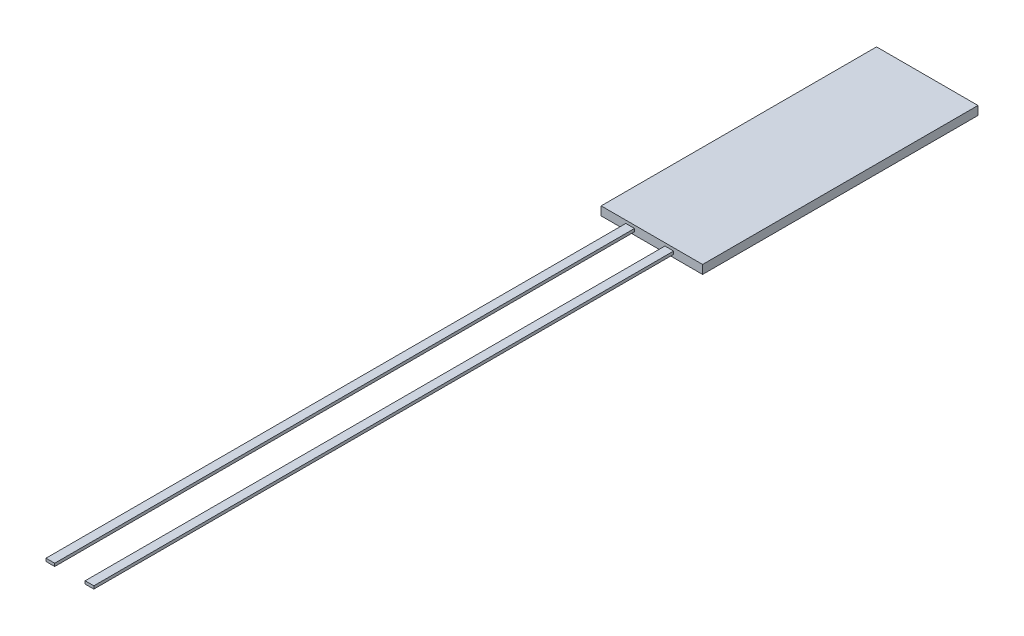
ISO-10303-21;
HEADER;
FILE_DESCRIPTION(('STEP AP214'),'2;1');
FILE_NAME('part.step','',(''),(''),'','','');
FILE_SCHEMA(('AUTOMOTIVE_DESIGN { 1 0 10303 214 1 1 1 1 }'));
ENDSEC;
DATA;
#1=APPLICATION_CONTEXT('core data for automotive mechanical design processes');
#2=APPLICATION_PROTOCOL_DEFINITION('international standard','automotive_design',2000,#1);
#3=PRODUCT_CONTEXT('',#1,'mechanical');
#4=PRODUCT('Part','Part','',(#3));
#5=PRODUCT_RELATED_PRODUCT_CATEGORY('part','',(#4));
#6=PRODUCT_DEFINITION_FORMATION('','',#4);
#7=PRODUCT_DEFINITION_CONTEXT('part definition',#1,'design');
#8=PRODUCT_DEFINITION('design','',#6,#7);
#9=PRODUCT_DEFINITION_SHAPE('','',#8);
#10=(LENGTH_UNIT() NAMED_UNIT(*) SI_UNIT(.MILLI.,.METRE.));
#11=(NAMED_UNIT(*) PLANE_ANGLE_UNIT() SI_UNIT($,.RADIAN.));
#12=(NAMED_UNIT(*) SI_UNIT($,.STERADIAN.) SOLID_ANGLE_UNIT());
#13=UNCERTAINTY_MEASURE_WITH_UNIT(LENGTH_MEASURE(1.E-05),#10,'distance_accuracy_value','');
#14=(GEOMETRIC_REPRESENTATION_CONTEXT(3) GLOBAL_UNCERTAINTY_ASSIGNED_CONTEXT((#13)) GLOBAL_UNIT_ASSIGNED_CONTEXT((#10,
#11,#12)) REPRESENTATION_CONTEXT('',''));
#15=CARTESIAN_POINT('',(0.,0.,0.));
#16=DIRECTION('',(0.,0.,1.));
#17=DIRECTION('',(1.,0.,0.));
#18=AXIS2_PLACEMENT_3D('',#15,#16,#17);
#19=CARTESIAN_POINT('',(-1.75,0.3,4.75));
#20=DIRECTION('',(0.,0.,-1.));
#21=DIRECTION('',(-1.,0.,0.));
#22=AXIS2_PLACEMENT_3D('',#19,#20,#21);
#23=PLANE('',#22);
#24=DIRECTION('',(0.,1.,0.));
#25=VECTOR('',#24,1.);
#26=CARTESIAN_POINT('',(-0.600000000000001,0.2,4.75));
#27=LINE('',#26,#25);
#28=CARTESIAN_POINT('',(-0.600000000000001,0.1,4.75));
#29=VERTEX_POINT('',#28);
#30=CARTESIAN_POINT('',(-0.600000000000001,0.2,4.75));
#31=VERTEX_POINT('',#30);
#32=EDGE_CURVE('E148',#29,#31,#27,.T.);
#33=ORIENTED_EDGE('',*,*,#32,.F.);
#34=DIRECTION('',(1.,0.,0.));
#35=VECTOR('',#34,1.);
#36=CARTESIAN_POINT('',(-0.900000000000001,0.1,4.75));
#37=LINE('',#36,#35);
#38=CARTESIAN_POINT('',(-0.900000000000001,0.1,4.75));
#39=VERTEX_POINT('',#38);
#40=EDGE_CURVE('E161',#39,#29,#37,.T.);
#41=ORIENTED_EDGE('',*,*,#40,.F.);
#42=DIRECTION('',(0.,-1.,0.));
#43=VECTOR('',#42,1.);
#44=CARTESIAN_POINT('',(-0.900000000000001,0.2,4.75));
#45=LINE('',#44,#43);
#46=CARTESIAN_POINT('',(-0.900000000000001,0.2,4.75));
#47=VERTEX_POINT('',#46);
#48=EDGE_CURVE('E170',#47,#39,#45,.T.);
#49=ORIENTED_EDGE('',*,*,#48,.F.);
#50=DIRECTION('',(-1.,0.,0.));
#51=VECTOR('',#50,1.);
#52=CARTESIAN_POINT('',(-0.900000000000001,0.2,4.75));
#53=LINE('',#52,#51);
#54=EDGE_CURVE('E151',#31,#47,#53,.T.);
#55=ORIENTED_EDGE('',*,*,#54,.F.);
#56=EDGE_LOOP('',(#33,#41,#49,#55));
#57=FACE_BOUND('',#56,.T.);
#58=DIRECTION('',(1.,0.,0.));
#59=VECTOR('',#58,1.);
#60=CARTESIAN_POINT('',(-1.75,0.,4.75));
#61=LINE('',#60,#59);
#62=CARTESIAN_POINT('',(-1.75,0.,4.75));
#63=VERTEX_POINT('',#62);
#64=CARTESIAN_POINT('',(1.75,0.,4.75));
#65=VERTEX_POINT('',#64);
#66=EDGE_CURVE('E191',#63,#65,#61,.T.);
#67=ORIENTED_EDGE('',*,*,#66,.T.);
#68=DIRECTION('',(0.,-1.,0.));
#69=VECTOR('',#68,1.);
#70=CARTESIAN_POINT('',(1.75,0.3,4.75));
#71=LINE('',#70,#69);
#72=CARTESIAN_POINT('',(1.75,0.3,4.75));
#73=VERTEX_POINT('',#72);
#74=EDGE_CURVE('E197',#73,#65,#71,.T.);
#75=ORIENTED_EDGE('',*,*,#74,.F.);
#76=DIRECTION('',(1.,0.,0.));
#77=VECTOR('',#76,1.);
#78=CARTESIAN_POINT('',(-1.75,0.3,4.75));
#79=LINE('',#78,#77);
#80=CARTESIAN_POINT('',(-1.75,0.3,4.75));
#81=VERTEX_POINT('',#80);
#82=EDGE_CURVE('E195',#81,#73,#79,.T.);
#83=ORIENTED_EDGE('',*,*,#82,.F.);
#84=DIRECTION('',(0.,-1.,0.));
#85=VECTOR('',#84,1.);
#86=CARTESIAN_POINT('',(-1.75,0.3,4.75));
#87=LINE('',#86,#85);
#88=EDGE_CURVE('E207',#81,#63,#87,.T.);
#89=ORIENTED_EDGE('',*,*,#88,.T.);
#90=EDGE_LOOP('',(#67,#75,#83,#89));
#91=FACE_BOUND('',#90,.T.);
#92=DIRECTION('',(1.,0.,0.));
#93=VECTOR('',#92,1.);
#94=CARTESIAN_POINT('',(0.450000000000001,0.1,4.75));
#95=LINE('',#94,#93);
#96=CARTESIAN_POINT('',(0.450000000000001,0.1,4.75));
#97=VERTEX_POINT('',#96);
#98=CARTESIAN_POINT('',(0.75,0.1,4.75));
#99=VERTEX_POINT('',#98);
#100=EDGE_CURVE('E147',#97,#99,#95,.T.);
#101=ORIENTED_EDGE('',*,*,#100,.F.);
#102=DIRECTION('',(0.,-1.,0.));
#103=VECTOR('',#102,1.);
#104=CARTESIAN_POINT('',(0.450000000000001,0.2,4.75));
#105=LINE('',#104,#103);
#106=CARTESIAN_POINT('',(0.450000000000001,0.2,4.75));
#107=VERTEX_POINT('',#106);
#108=EDGE_CURVE('E144',#107,#97,#105,.T.);
#109=ORIENTED_EDGE('',*,*,#108,.F.);
#110=DIRECTION('',(-1.,0.,0.));
#111=VECTOR('',#110,1.);
#112=CARTESIAN_POINT('',(0.450000000000001,0.2,4.75));
#113=LINE('',#112,#111);
#114=CARTESIAN_POINT('',(0.75,0.2,4.75));
#115=VERTEX_POINT('',#114);
#116=EDGE_CURVE('E58',#115,#107,#113,.T.);
#117=ORIENTED_EDGE('',*,*,#116,.F.);
#118=DIRECTION('',(0.,1.,0.));
#119=VECTOR('',#118,1.);
#120=CARTESIAN_POINT('',(0.75,0.2,4.75));
#121=LINE('',#120,#119);
#122=EDGE_CURVE('E53',#99,#115,#121,.T.);
#123=ORIENTED_EDGE('',*,*,#122,.F.);
#124=EDGE_LOOP('',(#101,#109,#117,#123));
#125=FACE_BOUND('',#124,.T.);
#126=ADVANCED_FACE('F38',(#57,#91,#125),#23,.F.);
#127=CARTESIAN_POINT('',(1.75,0.3,-4.75));
#128=DIRECTION('',(-1.,0.,0.));
#129=DIRECTION('',(0.,0.,1.));
#130=AXIS2_PLACEMENT_3D('',#127,#128,#129);
#131=PLANE('',#130);
#132=DIRECTION('',(0.,0.,-1.));
#133=VECTOR('',#132,1.);
#134=CARTESIAN_POINT('',(1.75,0.,-4.75));
#135=LINE('',#134,#133);
#136=CARTESIAN_POINT('',(1.75,0.,-4.75));
#137=VERTEX_POINT('',#136);
#138=EDGE_CURVE('E186',#65,#137,#135,.T.);
#139=ORIENTED_EDGE('',*,*,#138,.T.);
#140=DIRECTION('',(0.,-1.,0.));
#141=VECTOR('',#140,1.);
#142=CARTESIAN_POINT('',(1.75,0.3,-4.75));
#143=LINE('',#142,#141);
#144=CARTESIAN_POINT('',(1.75,0.3,-4.75));
#145=VERTEX_POINT('',#144);
#146=EDGE_CURVE('E11',#145,#137,#143,.T.);
#147=ORIENTED_EDGE('',*,*,#146,.F.);
#148=DIRECTION('',(0.,0.,-1.));
#149=VECTOR('',#148,1.);
#150=CARTESIAN_POINT('',(1.75,0.3,-4.75));
#151=LINE('',#150,#149);
#152=EDGE_CURVE('E187',#73,#145,#151,.T.);
#153=ORIENTED_EDGE('',*,*,#152,.F.);
#154=ORIENTED_EDGE('',*,*,#74,.T.);
#155=EDGE_LOOP('',(#139,#147,#153,#154));
#156=FACE_BOUND('',#155,.T.);
#157=ADVANCED_FACE('F40',(#156),#131,.F.);
#158=CARTESIAN_POINT('',(-1.75,0.3,-4.75));
#159=DIRECTION('',(0.,0.,1.));
#160=DIRECTION('',(1.,0.,0.));
#161=AXIS2_PLACEMENT_3D('',#158,#159,#160);
#162=PLANE('',#161);
#163=DIRECTION('',(-1.,0.,0.));
#164=VECTOR('',#163,1.);
#165=CARTESIAN_POINT('',(-1.75,0.,-4.75));
#166=LINE('',#165,#164);
#167=CARTESIAN_POINT('',(-1.75,0.,-4.75));
#168=VERTEX_POINT('',#167);
#169=EDGE_CURVE('E200',#137,#168,#166,.T.);
#170=ORIENTED_EDGE('',*,*,#169,.T.);
#171=DIRECTION('',(0.,-1.,0.));
#172=VECTOR('',#171,1.);
#173=CARTESIAN_POINT('',(-1.75,0.3,-4.75));
#174=LINE('',#173,#172);
#175=CARTESIAN_POINT('',(-1.75,0.3,-4.75));
#176=VERTEX_POINT('',#175);
#177=EDGE_CURVE('E46',#176,#168,#174,.T.);
#178=ORIENTED_EDGE('',*,*,#177,.F.);
#179=DIRECTION('',(-1.,0.,0.));
#180=VECTOR('',#179,1.);
#181=CARTESIAN_POINT('',(-1.75,0.3,-4.75));
#182=LINE('',#181,#180);
#183=EDGE_CURVE('E190',#145,#176,#182,.T.);
#184=ORIENTED_EDGE('',*,*,#183,.F.);
#185=ORIENTED_EDGE('',*,*,#146,.T.);
#186=EDGE_LOOP('',(#170,#178,#184,#185));
#187=FACE_BOUND('',#186,.T.);
#188=ADVANCED_FACE('F229',(#187),#162,.F.);
#189=CARTESIAN_POINT('',(-1.75,0.3,-4.75));
#190=DIRECTION('',(1.,0.,0.));
#191=DIRECTION('',(0.,0.,-1.));
#192=AXIS2_PLACEMENT_3D('',#189,#190,#191);
#193=PLANE('',#192);
#194=DIRECTION('',(0.,0.,1.));
#195=VECTOR('',#194,1.);
#196=CARTESIAN_POINT('',(-1.75,0.,-4.75));
#197=LINE('',#196,#195);
#198=EDGE_CURVE('E202',#168,#63,#197,.T.);
#199=ORIENTED_EDGE('',*,*,#198,.T.);
#200=ORIENTED_EDGE('',*,*,#88,.F.);
#201=DIRECTION('',(0.,0.,1.));
#202=VECTOR('',#201,1.);
#203=CARTESIAN_POINT('',(-1.75,0.3,-4.75));
#204=LINE('',#203,#202);
#205=EDGE_CURVE('E193',#176,#81,#204,.T.);
#206=ORIENTED_EDGE('',*,*,#205,.F.);
#207=ORIENTED_EDGE('',*,*,#177,.T.);
#208=EDGE_LOOP('',(#199,#200,#206,#207));
#209=FACE_BOUND('',#208,.T.);
#210=ADVANCED_FACE('F214',(#209),#193,.F.);
#211=CARTESIAN_POINT('',(0.,0.3,0.));
#212=DIRECTION('',(0.,1.,0.));
#213=DIRECTION('',(0.,0.,1.));
#214=AXIS2_PLACEMENT_3D('',#211,#212,#213);
#215=PLANE('',#214);
#216=ORIENTED_EDGE('',*,*,#152,.T.);
#217=ORIENTED_EDGE('',*,*,#183,.T.);
#218=ORIENTED_EDGE('',*,*,#205,.T.);
#219=ORIENTED_EDGE('',*,*,#82,.T.);
#220=EDGE_LOOP('',(#216,#217,#218,#219));
#221=FACE_BOUND('',#220,.T.);
#222=ADVANCED_FACE('F228',(#221),#215,.T.);
#223=CARTESIAN_POINT('',(0.,0.,0.));
#224=DIRECTION('',(0.,1.,0.));
#225=DIRECTION('',(0.,0.,1.));
#226=AXIS2_PLACEMENT_3D('',#223,#224,#225);
#227=PLANE('',#226);
#228=ORIENTED_EDGE('',*,*,#138,.F.);
#229=ORIENTED_EDGE('',*,*,#66,.F.);
#230=ORIENTED_EDGE('',*,*,#198,.F.);
#231=ORIENTED_EDGE('',*,*,#169,.F.);
#232=EDGE_LOOP('',(#228,#229,#230,#231));
#233=FACE_BOUND('',#232,.T.);
#234=ADVANCED_FACE('F220',(#233),#227,.F.);
#235=CARTESIAN_POINT('',(-0.600000000000001,0.2,24.75));
#236=DIRECTION('',(-1.,0.,0.));
#237=DIRECTION('',(0.,0.,1.));
#238=AXIS2_PLACEMENT_3D('',#235,#236,#237);
#239=PLANE('',#238);
#240=ORIENTED_EDGE('',*,*,#32,.T.);
#241=DIRECTION('',(0.,0.,-1.));
#242=VECTOR('',#241,1.);
#243=CARTESIAN_POINT('',(-0.600000000000001,0.2,24.75));
#244=LINE('',#243,#242);
#245=CARTESIAN_POINT('',(-0.600000000000001,0.2,24.75));
#246=VERTEX_POINT('',#245);
#247=EDGE_CURVE('E183',#246,#31,#244,.T.);
#248=ORIENTED_EDGE('',*,*,#247,.F.);
#249=DIRECTION('',(0.,1.,0.));
#250=VECTOR('',#249,1.);
#251=CARTESIAN_POINT('',(-0.600000000000001,0.2,24.75));
#252=LINE('',#251,#250);
#253=CARTESIAN_POINT('',(-0.600000000000001,0.1,24.75));
#254=VERTEX_POINT('',#253);
#255=EDGE_CURVE('E157',#254,#246,#252,.T.);
#256=ORIENTED_EDGE('',*,*,#255,.F.);
#257=DIRECTION('',(0.,0.,-1.));
#258=VECTOR('',#257,1.);
#259=CARTESIAN_POINT('',(-0.600000000000001,0.1,24.75));
#260=LINE('',#259,#258);
#261=EDGE_CURVE('E166',#254,#29,#260,.T.);
#262=ORIENTED_EDGE('',*,*,#261,.T.);
#263=EDGE_LOOP('',(#240,#248,#256,#262));
#264=FACE_BOUND('',#263,.T.);
#265=ADVANCED_FACE('F244',(#264),#239,.F.);
#266=CARTESIAN_POINT('',(-0.900000000000001,0.2,24.75));
#267=DIRECTION('',(0.,-1.,0.));
#268=DIRECTION('',(0.,0.,-1.));
#269=AXIS2_PLACEMENT_3D('',#266,#267,#268);
#270=PLANE('',#269);
#271=ORIENTED_EDGE('',*,*,#54,.T.);
#272=DIRECTION('',(0.,0.,-1.));
#273=VECTOR('',#272,1.);
#274=CARTESIAN_POINT('',(-0.900000000000001,0.2,24.75));
#275=LINE('',#274,#273);
#276=CARTESIAN_POINT('',(-0.900000000000001,0.2,24.75));
#277=VERTEX_POINT('',#276);
#278=EDGE_CURVE('E180',#277,#47,#275,.T.);
#279=ORIENTED_EDGE('',*,*,#278,.F.);
#280=DIRECTION('',(-1.,0.,0.));
#281=VECTOR('',#280,1.);
#282=CARTESIAN_POINT('',(-0.900000000000001,0.2,24.75));
#283=LINE('',#282,#281);
#284=EDGE_CURVE('E160',#246,#277,#283,.T.);
#285=ORIENTED_EDGE('',*,*,#284,.F.);
#286=ORIENTED_EDGE('',*,*,#247,.T.);
#287=EDGE_LOOP('',(#271,#279,#285,#286));
#288=FACE_BOUND('',#287,.T.);
#289=ADVANCED_FACE('F249',(#288),#270,.F.);
#290=CARTESIAN_POINT('',(-0.900000000000001,0.2,24.75));
#291=DIRECTION('',(1.,0.,0.));
#292=DIRECTION('',(0.,0.,-1.));
#293=AXIS2_PLACEMENT_3D('',#290,#291,#292);
#294=PLANE('',#293);
#295=ORIENTED_EDGE('',*,*,#48,.T.);
#296=DIRECTION('',(0.,0.,-1.));
#297=VECTOR('',#296,1.);
#298=CARTESIAN_POINT('',(-0.900000000000001,0.1,24.75));
#299=LINE('',#298,#297);
#300=CARTESIAN_POINT('',(-0.900000000000001,0.1,24.75));
#301=VERTEX_POINT('',#300);
#302=EDGE_CURVE('E177',#301,#39,#299,.T.);
#303=ORIENTED_EDGE('',*,*,#302,.F.);
#304=DIRECTION('',(0.,-1.,0.));
#305=VECTOR('',#304,1.);
#306=CARTESIAN_POINT('',(-0.900000000000001,0.2,24.75));
#307=LINE('',#306,#305);
#308=EDGE_CURVE('E163',#277,#301,#307,.T.);
#309=ORIENTED_EDGE('',*,*,#308,.F.);
#310=ORIENTED_EDGE('',*,*,#278,.T.);
#311=EDGE_LOOP('',(#295,#303,#309,#310));
#312=FACE_BOUND('',#311,.T.);
#313=ADVANCED_FACE('F253',(#312),#294,.F.);
#314=CARTESIAN_POINT('',(-0.900000000000001,0.1,24.75));
#315=DIRECTION('',(0.,1.,0.));
#316=DIRECTION('',(0.,0.,1.));
#317=AXIS2_PLACEMENT_3D('',#314,#315,#316);
#318=PLANE('',#317);
#319=ORIENTED_EDGE('',*,*,#40,.T.);
#320=ORIENTED_EDGE('',*,*,#261,.F.);
#321=DIRECTION('',(1.,0.,0.));
#322=VECTOR('',#321,1.);
#323=CARTESIAN_POINT('',(-0.900000000000001,0.1,24.75));
#324=LINE('',#323,#322);
#325=EDGE_CURVE('E165',#301,#254,#324,.T.);
#326=ORIENTED_EDGE('',*,*,#325,.F.);
#327=ORIENTED_EDGE('',*,*,#302,.T.);
#328=EDGE_LOOP('',(#319,#320,#326,#327));
#329=FACE_BOUND('',#328,.T.);
#330=ADVANCED_FACE('F257',(#329),#318,.F.);
#331=CARTESIAN_POINT('',(0.,0.,24.75));
#332=DIRECTION('',(0.,0.,1.));
#333=DIRECTION('',(1.,0.,0.));
#334=AXIS2_PLACEMENT_3D('',#331,#332,#333);
#335=PLANE('',#334);
#336=ORIENTED_EDGE('',*,*,#255,.T.);
#337=ORIENTED_EDGE('',*,*,#284,.T.);
#338=ORIENTED_EDGE('',*,*,#308,.T.);
#339=ORIENTED_EDGE('',*,*,#325,.T.);
#340=EDGE_LOOP('',(#336,#337,#338,#339));
#341=FACE_BOUND('',#340,.T.);
#342=ADVANCED_FACE('F261',(#341),#335,.T.);
#343=CARTESIAN_POINT('',(0.450000000000001,0.1,24.75));
#344=DIRECTION('',(0.,1.,0.));
#345=DIRECTION('',(-1.,0.,0.));
#346=AXIS2_PLACEMENT_3D('',#343,#344,#345);
#347=PLANE('',#346);
#348=ORIENTED_EDGE('',*,*,#100,.T.);
#349=DIRECTION('',(0.,0.,-1.));
#350=VECTOR('',#349,1.);
#351=CARTESIAN_POINT('',(0.75,0.1,24.75));
#352=LINE('',#351,#350);
#353=CARTESIAN_POINT('',(0.75,0.1,24.75));
#354=VERTEX_POINT('',#353);
#355=EDGE_CURVE('E128',#354,#99,#352,.T.);
#356=ORIENTED_EDGE('',*,*,#355,.F.);
#357=DIRECTION('',(1.,0.,0.));
#358=VECTOR('',#357,1.);
#359=CARTESIAN_POINT('',(0.450000000000001,0.1,24.75));
#360=LINE('',#359,#358);
#361=CARTESIAN_POINT('',(0.450000000000001,0.1,24.75));
#362=VERTEX_POINT('',#361);
#363=EDGE_CURVE('E135',#362,#354,#360,.T.);
#364=ORIENTED_EDGE('',*,*,#363,.F.);
#365=DIRECTION('',(0.,0.,-1.));
#366=VECTOR('',#365,1.);
#367=CARTESIAN_POINT('',(0.450000000000001,0.1,24.75));
#368=LINE('',#367,#366);
#369=EDGE_CURVE('E373',#362,#97,#368,.T.);
#370=ORIENTED_EDGE('',*,*,#369,.T.);
#371=EDGE_LOOP('',(#348,#356,#364,#370));
#372=FACE_BOUND('',#371,.T.);
#373=ADVANCED_FACE('F146',(#372),#347,.F.);
#374=CARTESIAN_POINT('',(0.75,0.2,24.75));
#375=DIRECTION('',(-1.,0.,0.));
#376=DIRECTION('',(0.,0.,1.));
#377=AXIS2_PLACEMENT_3D('',#374,#375,#376);
#378=PLANE('',#377);
#379=ORIENTED_EDGE('',*,*,#122,.T.);
#380=DIRECTION('',(0.,0.,-1.));
#381=VECTOR('',#380,1.);
#382=CARTESIAN_POINT('',(0.75,0.2,24.75));
#383=LINE('',#382,#381);
#384=CARTESIAN_POINT('',(0.75,0.2,24.75));
#385=VERTEX_POINT('',#384);
#386=EDGE_CURVE('E131',#385,#115,#383,.T.);
#387=ORIENTED_EDGE('',*,*,#386,.F.);
#388=DIRECTION('',(0.,1.,0.));
#389=VECTOR('',#388,1.);
#390=CARTESIAN_POINT('',(0.75,0.2,24.75));
#391=LINE('',#390,#389);
#392=EDGE_CURVE('E124',#354,#385,#391,.T.);
#393=ORIENTED_EDGE('',*,*,#392,.F.);
#394=ORIENTED_EDGE('',*,*,#355,.T.);
#395=EDGE_LOOP('',(#379,#387,#393,#394));
#396=FACE_BOUND('',#395,.T.);
#397=ADVANCED_FACE('F126',(#396),#378,.F.);
#398=CARTESIAN_POINT('',(0.450000000000001,0.2,24.75));
#399=DIRECTION('',(0.,-1.,0.));
#400=DIRECTION('',(1.,0.,0.));
#401=AXIS2_PLACEMENT_3D('',#398,#399,#400);
#402=PLANE('',#401);
#403=ORIENTED_EDGE('',*,*,#116,.T.);
#404=DIRECTION('',(0.,0.,-1.));
#405=VECTOR('',#404,1.);
#406=CARTESIAN_POINT('',(0.450000000000001,0.2,24.75));
#407=LINE('',#406,#405);
#408=CARTESIAN_POINT('',(0.450000000000001,0.2,24.75));
#409=VERTEX_POINT('',#408);
#410=EDGE_CURVE('E153',#409,#107,#407,.T.);
#411=ORIENTED_EDGE('',*,*,#410,.F.);
#412=DIRECTION('',(-1.,0.,0.));
#413=VECTOR('',#412,1.);
#414=CARTESIAN_POINT('',(0.450000000000001,0.2,24.75));
#415=LINE('',#414,#413);
#416=EDGE_CURVE('E134',#385,#409,#415,.T.);
#417=ORIENTED_EDGE('',*,*,#416,.F.);
#418=ORIENTED_EDGE('',*,*,#386,.T.);
#419=EDGE_LOOP('',(#403,#411,#417,#418));
#420=FACE_BOUND('',#419,.T.);
#421=ADVANCED_FACE('F270',(#420),#402,.F.);
#422=CARTESIAN_POINT('',(0.450000000000001,0.2,24.75));
#423=DIRECTION('',(1.,0.,0.));
#424=DIRECTION('',(0.,0.,-1.));
#425=AXIS2_PLACEMENT_3D('',#422,#423,#424);
#426=PLANE('',#425);
#427=ORIENTED_EDGE('',*,*,#108,.T.);
#428=ORIENTED_EDGE('',*,*,#369,.F.);
#429=DIRECTION('',(0.,-1.,0.));
#430=VECTOR('',#429,1.);
#431=CARTESIAN_POINT('',(0.450000000000001,0.2,24.75));
#432=LINE('',#431,#430);
#433=EDGE_CURVE('E140',#409,#362,#432,.T.);
#434=ORIENTED_EDGE('',*,*,#433,.F.);
#435=ORIENTED_EDGE('',*,*,#410,.T.);
#436=EDGE_LOOP('',(#427,#428,#434,#435));
#437=FACE_BOUND('',#436,.T.);
#438=ADVANCED_FACE('F273',(#437),#426,.F.);
#439=CARTESIAN_POINT('',(0.,0.,24.75));
#440=DIRECTION('',(0.,0.,-1.));
#441=DIRECTION('',(-1.,0.,0.));
#442=AXIS2_PLACEMENT_3D('',#439,#440,#441);
#443=PLANE('',#442);
#444=ORIENTED_EDGE('',*,*,#363,.T.);
#445=ORIENTED_EDGE('',*,*,#392,.T.);
#446=ORIENTED_EDGE('',*,*,#416,.T.);
#447=ORIENTED_EDGE('',*,*,#433,.T.);
#448=EDGE_LOOP('',(#444,#445,#446,#447));
#449=FACE_BOUND('',#448,.T.);
#450=ADVANCED_FACE('F138',(#449),#443,.F.);
#451=CLOSED_SHELL('',(#126,#157,#188,#210,#222,#234,#265,#289,#313,#330,#342,#373,#397,#421,
#438,#450));
#452=MANIFOLD_SOLID_BREP('B2',#451);
#453=ADVANCED_BREP_SHAPE_REPRESENTATION('',(#18,#452),#14);
#454=SHAPE_DEFINITION_REPRESENTATION(#9,#453);
ENDSEC;
END-ISO-10303-21;
